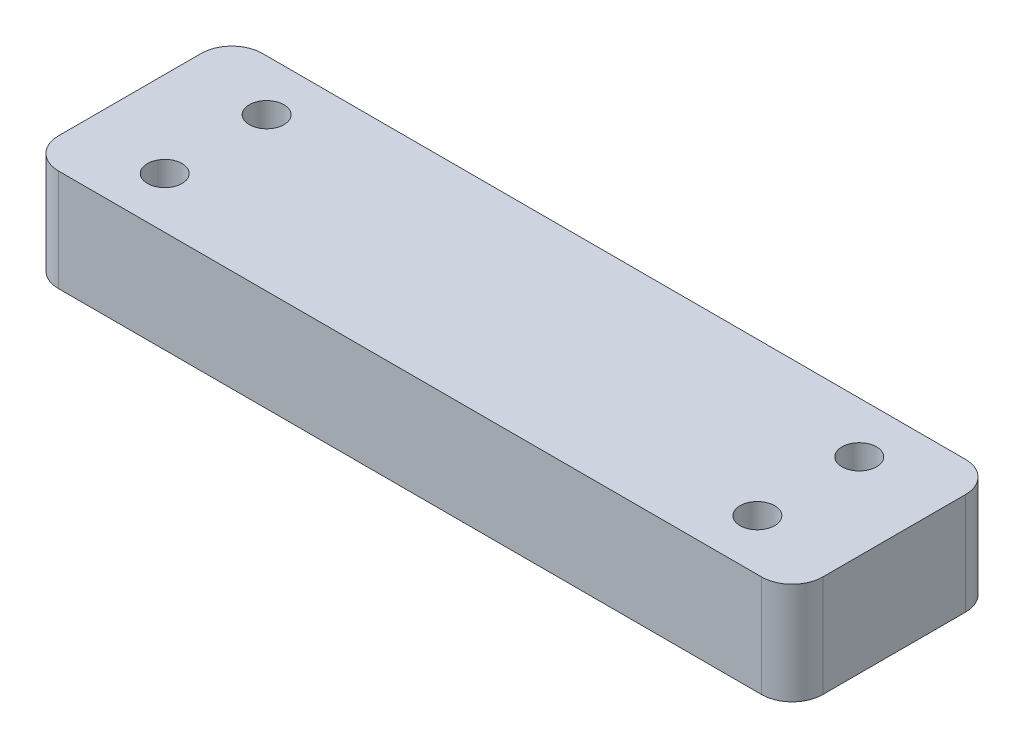
ISO-10303-21;
HEADER;
FILE_DESCRIPTION(('STEP AP214'),'2;1');
FILE_NAME('part.step','',(''),(''),'','','');
FILE_SCHEMA(('AUTOMOTIVE_DESIGN { 1 0 10303 214 1 1 1 1 }'));
ENDSEC;
DATA;
#1=APPLICATION_CONTEXT('core data for automotive mechanical design processes');
#2=APPLICATION_PROTOCOL_DEFINITION('international standard','automotive_design',2000,#1);
#3=PRODUCT_CONTEXT('',#1,'mechanical');
#4=PRODUCT('Part','Part','',(#3));
#5=PRODUCT_RELATED_PRODUCT_CATEGORY('part','',(#4));
#6=PRODUCT_DEFINITION_FORMATION('','',#4);
#7=PRODUCT_DEFINITION_CONTEXT('part definition',#1,'design');
#8=PRODUCT_DEFINITION('design','',#6,#7);
#9=PRODUCT_DEFINITION_SHAPE('','',#8);
#10=(LENGTH_UNIT() NAMED_UNIT(*) SI_UNIT(.MILLI.,.METRE.));
#11=(NAMED_UNIT(*) PLANE_ANGLE_UNIT() SI_UNIT($,.RADIAN.));
#12=(NAMED_UNIT(*) SI_UNIT($,.STERADIAN.) SOLID_ANGLE_UNIT());
#13=UNCERTAINTY_MEASURE_WITH_UNIT(LENGTH_MEASURE(1.E-05),#10,'distance_accuracy_value','');
#14=(GEOMETRIC_REPRESENTATION_CONTEXT(3) GLOBAL_UNCERTAINTY_ASSIGNED_CONTEXT((#13)) GLOBAL_UNIT_ASSIGNED_CONTEXT((#10,
#11,#12)) REPRESENTATION_CONTEXT('',''));
#15=CARTESIAN_POINT('',(0.,0.,0.));
#16=DIRECTION('',(0.,0.,1.));
#17=DIRECTION('',(1.,0.,0.));
#18=AXIS2_PLACEMENT_3D('',#15,#16,#17);
#19=CARTESIAN_POINT('',(0.,10.,0.));
#20=DIRECTION('',(0.,-1.,0.));
#21=DIRECTION('',(0.,0.,-1.));
#22=AXIS2_PLACEMENT_3D('',#19,#20,#21);
#23=PLANE('',#22);
#24=CARTESIAN_POINT('',(66.5810000000001,10.,-15.));
#25=DIRECTION('',(0.,1.,0.));
#26=DIRECTION('',(0.,0.,1.));
#27=AXIS2_PLACEMENT_3D('',#24,#25,#26);
#28=CIRCLE('',#27,1.69999999999999);
#29=CARTESIAN_POINT('',(66.5810000000001,10.,-13.3));
#30=VERTEX_POINT('',#29);
#31=EDGE_CURVE('E194',#30,#30,#28,.T.);
#32=ORIENTED_EDGE('',*,*,#31,.F.);
#33=EDGE_LOOP('',(#32));
#34=FACE_BOUND('',#33,.T.);
#35=DIRECTION('',(-1.,0.,0.));
#36=VECTOR('',#35,1.);
#37=CARTESIAN_POINT('',(0.,10.,-20.));
#38=LINE('',#37,#36);
#39=CARTESIAN_POINT('',(72.,10.,-20.));
#40=VERTEX_POINT('',#39);
#41=CARTESIAN_POINT('',(3.,10.,-20.));
#42=VERTEX_POINT('',#41);
#43=EDGE_CURVE('E134',#40,#42,#38,.T.);
#44=ORIENTED_EDGE('',*,*,#43,.T.);
#45=CARTESIAN_POINT('',(3.,10.,-17.));
#46=DIRECTION('',(0.,-1.,0.));
#47=DIRECTION('',(0.,0.,-1.));
#48=AXIS2_PLACEMENT_3D('',#45,#46,#47);
#49=CIRCLE('',#48,3.);
#50=CARTESIAN_POINT('',(0.,10.,-17.));
#51=VERTEX_POINT('',#50);
#52=EDGE_CURVE('E153',#42,#51,#49,.F.);
#53=ORIENTED_EDGE('',*,*,#52,.T.);
#54=DIRECTION('',(0.,0.,1.));
#55=VECTOR('',#54,1.);
#56=CARTESIAN_POINT('',(0.,10.,0.));
#57=LINE('',#56,#55);
#58=CARTESIAN_POINT('',(0.,10.,-3.));
#59=VERTEX_POINT('',#58);
#60=EDGE_CURVE('E118',#51,#59,#57,.T.);
#61=ORIENTED_EDGE('',*,*,#60,.T.);
#62=CARTESIAN_POINT('',(3.,10.,-3.));
#63=DIRECTION('',(0.,-1.,0.));
#64=DIRECTION('',(0.,0.,-1.));
#65=AXIS2_PLACEMENT_3D('',#62,#63,#64);
#66=CIRCLE('',#65,3.);
#67=CARTESIAN_POINT('',(3.,10.,0.));
#68=VERTEX_POINT('',#67);
#69=EDGE_CURVE('E151',#59,#68,#66,.F.);
#70=ORIENTED_EDGE('',*,*,#69,.T.);
#71=DIRECTION('',(1.,0.,0.));
#72=VECTOR('',#71,1.);
#73=CARTESIAN_POINT('',(0.,10.,0.));
#74=LINE('',#73,#72);
#75=CARTESIAN_POINT('',(72.,10.,0.));
#76=VERTEX_POINT('',#75);
#77=EDGE_CURVE('E173',#68,#76,#74,.T.);
#78=ORIENTED_EDGE('',*,*,#77,.T.);
#79=CARTESIAN_POINT('',(72.,10.,-3.));
#80=DIRECTION('',(0.,-1.,0.));
#81=DIRECTION('',(0.,0.,-1.));
#82=AXIS2_PLACEMENT_3D('',#79,#80,#81);
#83=CIRCLE('',#82,3.);
#84=CARTESIAN_POINT('',(75.,10.,-3.));
#85=VERTEX_POINT('',#84);
#86=EDGE_CURVE('E53',#76,#85,#83,.F.);
#87=ORIENTED_EDGE('',*,*,#86,.T.);
#88=DIRECTION('',(0.,0.,-1.));
#89=VECTOR('',#88,1.);
#90=CARTESIAN_POINT('',(75.,10.,0.));
#91=LINE('',#90,#89);
#92=CARTESIAN_POINT('',(75.,10.,-17.));
#93=VERTEX_POINT('',#92);
#94=EDGE_CURVE('E163',#85,#93,#91,.T.);
#95=ORIENTED_EDGE('',*,*,#94,.T.);
#96=CARTESIAN_POINT('',(72.,10.,-17.));
#97=DIRECTION('',(0.,-1.,0.));
#98=DIRECTION('',(0.,0.,-1.));
#99=AXIS2_PLACEMENT_3D('',#96,#97,#98);
#100=CIRCLE('',#99,3.);
#101=EDGE_CURVE('E149',#93,#40,#100,.F.);
#102=ORIENTED_EDGE('',*,*,#101,.T.);
#103=EDGE_LOOP('',(#44,#53,#61,#70,#78,#87,#95,#102));
#104=FACE_BOUND('',#103,.T.);
#105=CARTESIAN_POINT('',(8.41899999999998,10.,-15.));
#106=DIRECTION('',(0.,1.,0.));
#107=DIRECTION('',(0.,0.,1.));
#108=AXIS2_PLACEMENT_3D('',#105,#106,#107);
#109=CIRCLE('',#108,1.69999999999999);
#110=CARTESIAN_POINT('',(8.41899999999998,10.,-13.3));
#111=VERTEX_POINT('',#110);
#112=EDGE_CURVE('E131',#111,#111,#109,.T.);
#113=ORIENTED_EDGE('',*,*,#112,.F.);
#114=EDGE_LOOP('',(#113));
#115=FACE_BOUND('',#114,.T.);
#116=CARTESIAN_POINT('',(8.41899999999998,10.,-5.));
#117=DIRECTION('',(0.,1.,0.));
#118=DIRECTION('',(0.,0.,1.));
#119=AXIS2_PLACEMENT_3D('',#116,#117,#118);
#120=CIRCLE('',#119,1.69999999999999);
#121=CARTESIAN_POINT('',(8.41899999999998,10.,-3.30000000000001));
#122=VERTEX_POINT('',#121);
#123=EDGE_CURVE('E182',#122,#122,#120,.T.);
#124=ORIENTED_EDGE('',*,*,#123,.F.);
#125=EDGE_LOOP('',(#124));
#126=FACE_BOUND('',#125,.T.);
#127=CARTESIAN_POINT('',(66.5810000000001,10.,-5.));
#128=DIRECTION('',(0.,1.,0.));
#129=DIRECTION('',(0.,0.,1.));
#130=AXIS2_PLACEMENT_3D('',#127,#128,#129);
#131=CIRCLE('',#130,1.69999999999999);
#132=CARTESIAN_POINT('',(66.5810000000001,10.,-3.30000000000001));
#133=VERTEX_POINT('',#132);
#134=EDGE_CURVE('E188',#133,#133,#131,.T.);
#135=ORIENTED_EDGE('',*,*,#134,.F.);
#136=EDGE_LOOP('',(#135));
#137=FACE_BOUND('',#136,.T.);
#138=ADVANCED_FACE('F33',(#34,#104,#115,#126,#137),#23,.F.);
#139=CARTESIAN_POINT('',(0.,10.,0.));
#140=DIRECTION('',(1.,0.,0.));
#141=DIRECTION('',(0.,0.,-1.));
#142=AXIS2_PLACEMENT_3D('',#139,#140,#141);
#143=PLANE('',#142);
#144=ORIENTED_EDGE('',*,*,#60,.F.);
#145=DIRECTION('',(0.,-1.,0.));
#146=VECTOR('',#145,1.);
#147=CARTESIAN_POINT('',(0.,10.,-17.));
#148=LINE('',#147,#146);
#149=CARTESIAN_POINT('',(0.,0.,-17.));
#150=VERTEX_POINT('',#149);
#151=EDGE_CURVE('E102',#51,#150,#148,.T.);
#152=ORIENTED_EDGE('',*,*,#151,.T.);
#153=DIRECTION('',(0.,0.,1.));
#154=VECTOR('',#153,1.);
#155=CARTESIAN_POINT('',(0.,0.,0.));
#156=LINE('',#155,#154);
#157=CARTESIAN_POINT('',(0.,0.,-3.));
#158=VERTEX_POINT('',#157);
#159=EDGE_CURVE('E115',#150,#158,#156,.T.);
#160=ORIENTED_EDGE('',*,*,#159,.T.);
#161=DIRECTION('',(0.,-1.,0.));
#162=VECTOR('',#161,1.);
#163=CARTESIAN_POINT('',(0.,10.,-3.));
#164=LINE('',#163,#162);
#165=EDGE_CURVE('E120',#158,#59,#164,.F.);
#166=ORIENTED_EDGE('',*,*,#165,.T.);
#167=EDGE_LOOP('',(#144,#152,#160,#166));
#168=FACE_BOUND('',#167,.T.);
#169=ADVANCED_FACE('F114',(#168),#143,.F.);
#170=CARTESIAN_POINT('',(0.,10.,0.));
#171=DIRECTION('',(0.,0.,-1.));
#172=DIRECTION('',(-1.,0.,0.));
#173=AXIS2_PLACEMENT_3D('',#170,#171,#172);
#174=PLANE('',#173);
#175=ORIENTED_EDGE('',*,*,#77,.F.);
#176=DIRECTION('',(0.,-1.,0.));
#177=VECTOR('',#176,1.);
#178=CARTESIAN_POINT('',(3.,10.,0.));
#179=LINE('',#178,#177);
#180=CARTESIAN_POINT('',(3.,0.,0.));
#181=VERTEX_POINT('',#180);
#182=EDGE_CURVE('E157',#68,#181,#179,.T.);
#183=ORIENTED_EDGE('',*,*,#182,.T.);
#184=DIRECTION('',(1.,0.,0.));
#185=VECTOR('',#184,1.);
#186=CARTESIAN_POINT('',(0.,0.,0.));
#187=LINE('',#186,#185);
#188=CARTESIAN_POINT('',(72.,0.,0.));
#189=VERTEX_POINT('',#188);
#190=EDGE_CURVE('E124',#181,#189,#187,.T.);
#191=ORIENTED_EDGE('',*,*,#190,.T.);
#192=DIRECTION('',(0.,-1.,0.));
#193=VECTOR('',#192,1.);
#194=CARTESIAN_POINT('',(72.,10.,0.));
#195=LINE('',#194,#193);
#196=EDGE_CURVE('E155',#189,#76,#195,.F.);
#197=ORIENTED_EDGE('',*,*,#196,.T.);
#198=EDGE_LOOP('',(#175,#183,#191,#197));
#199=FACE_BOUND('',#198,.T.);
#200=ADVANCED_FACE('F235',(#199),#174,.F.);
#201=CARTESIAN_POINT('',(75.,10.,0.));
#202=DIRECTION('',(-1.,0.,0.));
#203=DIRECTION('',(0.,0.,1.));
#204=AXIS2_PLACEMENT_3D('',#201,#202,#203);
#205=PLANE('',#204);
#206=DIRECTION('',(0.,0.,-1.));
#207=VECTOR('',#206,1.);
#208=CARTESIAN_POINT('',(75.,0.,0.));
#209=LINE('',#208,#207);
#210=CARTESIAN_POINT('',(75.,0.,-3.));
#211=VERTEX_POINT('',#210);
#212=CARTESIAN_POINT('',(75.,0.,-17.));
#213=VERTEX_POINT('',#212);
#214=EDGE_CURVE('E128',#211,#213,#209,.T.);
#215=ORIENTED_EDGE('',*,*,#214,.T.);
#216=DIRECTION('',(0.,-1.,0.));
#217=VECTOR('',#216,1.);
#218=CARTESIAN_POINT('',(75.,10.,-17.));
#219=LINE('',#218,#217);
#220=EDGE_CURVE('E11',#213,#93,#219,.F.);
#221=ORIENTED_EDGE('',*,*,#220,.T.);
#222=ORIENTED_EDGE('',*,*,#94,.F.);
#223=DIRECTION('',(0.,-1.,0.));
#224=VECTOR('',#223,1.);
#225=CARTESIAN_POINT('',(75.,10.,-3.));
#226=LINE('',#225,#224);
#227=EDGE_CURVE('E41',#85,#211,#226,.T.);
#228=ORIENTED_EDGE('',*,*,#227,.T.);
#229=EDGE_LOOP('',(#215,#221,#222,#228));
#230=FACE_BOUND('',#229,.T.);
#231=ADVANCED_FACE('F162',(#230),#205,.F.);
#232=CARTESIAN_POINT('',(0.,10.,-20.));
#233=DIRECTION('',(0.,0.,1.));
#234=DIRECTION('',(1.,0.,0.));
#235=AXIS2_PLACEMENT_3D('',#232,#233,#234);
#236=PLANE('',#235);
#237=DIRECTION('',(-1.,0.,0.));
#238=VECTOR('',#237,1.);
#239=CARTESIAN_POINT('',(0.,0.,-20.));
#240=LINE('',#239,#238);
#241=CARTESIAN_POINT('',(72.,0.,-20.));
#242=VERTEX_POINT('',#241);
#243=CARTESIAN_POINT('',(3.,0.,-20.));
#244=VERTEX_POINT('',#243);
#245=EDGE_CURVE('E138',#242,#244,#240,.T.);
#246=ORIENTED_EDGE('',*,*,#245,.T.);
#247=DIRECTION('',(0.,-1.,0.));
#248=VECTOR('',#247,1.);
#249=CARTESIAN_POINT('',(3.,10.,-20.));
#250=LINE('',#249,#248);
#251=EDGE_CURVE('E103',#244,#42,#250,.F.);
#252=ORIENTED_EDGE('',*,*,#251,.T.);
#253=ORIENTED_EDGE('',*,*,#43,.F.);
#254=DIRECTION('',(0.,-1.,0.));
#255=VECTOR('',#254,1.);
#256=CARTESIAN_POINT('',(72.,10.,-20.));
#257=LINE('',#256,#255);
#258=EDGE_CURVE('E108',#40,#242,#257,.T.);
#259=ORIENTED_EDGE('',*,*,#258,.T.);
#260=EDGE_LOOP('',(#246,#252,#253,#259));
#261=FACE_BOUND('',#260,.T.);
#262=ADVANCED_FACE('F171',(#261),#236,.F.);
#263=CARTESIAN_POINT('',(0.,0.,0.));
#264=DIRECTION('',(0.,-1.,0.));
#265=DIRECTION('',(0.,0.,-1.));
#266=AXIS2_PLACEMENT_3D('',#263,#264,#265);
#267=PLANE('',#266);
#268=CARTESIAN_POINT('',(66.5810000000001,0.,-15.));
#269=DIRECTION('',(0.,1.,0.));
#270=DIRECTION('',(0.,0.,1.));
#271=AXIS2_PLACEMENT_3D('',#268,#269,#270);
#272=CIRCLE('',#271,1.69999999999998);
#273=CARTESIAN_POINT('',(66.5810000000001,0.,-13.3));
#274=VERTEX_POINT('',#273);
#275=EDGE_CURVE('E191',#274,#274,#272,.T.);
#276=ORIENTED_EDGE('',*,*,#275,.T.);
#277=EDGE_LOOP('',(#276));
#278=FACE_BOUND('',#277,.T.);
#279=CARTESIAN_POINT('',(66.5810000000001,0.,-5.));
#280=DIRECTION('',(0.,1.,0.));
#281=DIRECTION('',(0.,0.,1.));
#282=AXIS2_PLACEMENT_3D('',#279,#280,#281);
#283=CIRCLE('',#282,1.69999999999999);
#284=CARTESIAN_POINT('',(66.5810000000001,0.,-3.30000000000001));
#285=VERTEX_POINT('',#284);
#286=EDGE_CURVE('E185',#285,#285,#283,.T.);
#287=ORIENTED_EDGE('',*,*,#286,.T.);
#288=EDGE_LOOP('',(#287));
#289=FACE_BOUND('',#288,.T.);
#290=CARTESIAN_POINT('',(8.41899999999998,0.,-5.));
#291=DIRECTION('',(0.,1.,0.));
#292=DIRECTION('',(0.,0.,1.));
#293=AXIS2_PLACEMENT_3D('',#290,#291,#292);
#294=CIRCLE('',#293,1.69999999999999);
#295=CARTESIAN_POINT('',(8.41899999999998,0.,-3.30000000000001));
#296=VERTEX_POINT('',#295);
#297=EDGE_CURVE('E179',#296,#296,#294,.T.);
#298=ORIENTED_EDGE('',*,*,#297,.T.);
#299=EDGE_LOOP('',(#298));
#300=FACE_BOUND('',#299,.T.);
#301=CARTESIAN_POINT('',(8.41899999999998,0.,-15.));
#302=DIRECTION('',(0.,1.,0.));
#303=DIRECTION('',(0.,0.,1.));
#304=AXIS2_PLACEMENT_3D('',#301,#302,#303);
#305=CIRCLE('',#304,1.69999999999999);
#306=CARTESIAN_POINT('',(8.41899999999998,0.,-13.3));
#307=VERTEX_POINT('',#306);
#308=EDGE_CURVE('E125',#307,#307,#305,.T.);
#309=ORIENTED_EDGE('',*,*,#308,.T.);
#310=EDGE_LOOP('',(#309));
#311=FACE_BOUND('',#310,.T.);
#312=ORIENTED_EDGE('',*,*,#159,.F.);
#313=CARTESIAN_POINT('',(3.,0.,-17.));
#314=DIRECTION('',(0.,-1.,0.));
#315=DIRECTION('',(0.,0.,-1.));
#316=AXIS2_PLACEMENT_3D('',#313,#314,#315);
#317=CIRCLE('',#316,3.);
#318=EDGE_CURVE('E98',#150,#244,#317,.T.);
#319=ORIENTED_EDGE('',*,*,#318,.T.);
#320=ORIENTED_EDGE('',*,*,#245,.F.);
#321=CARTESIAN_POINT('',(72.,0.,-17.));
#322=DIRECTION('',(0.,-1.,0.));
#323=DIRECTION('',(0.,0.,-1.));
#324=AXIS2_PLACEMENT_3D('',#321,#322,#323);
#325=CIRCLE('',#324,3.);
#326=EDGE_CURVE('E142',#242,#213,#325,.T.);
#327=ORIENTED_EDGE('',*,*,#326,.T.);
#328=ORIENTED_EDGE('',*,*,#214,.F.);
#329=CARTESIAN_POINT('',(72.,0.,-3.));
#330=DIRECTION('',(0.,-1.,0.));
#331=DIRECTION('',(0.,0.,-1.));
#332=AXIS2_PLACEMENT_3D('',#329,#330,#331);
#333=CIRCLE('',#332,3.);
#334=EDGE_CURVE('E119',#211,#189,#333,.T.);
#335=ORIENTED_EDGE('',*,*,#334,.T.);
#336=ORIENTED_EDGE('',*,*,#190,.F.);
#337=CARTESIAN_POINT('',(3.,0.,-3.));
#338=DIRECTION('',(0.,-1.,0.));
#339=DIRECTION('',(0.,0.,-1.));
#340=AXIS2_PLACEMENT_3D('',#337,#338,#339);
#341=CIRCLE('',#340,3.);
#342=EDGE_CURVE('E109',#181,#158,#341,.T.);
#343=ORIENTED_EDGE('',*,*,#342,.T.);
#344=EDGE_LOOP('',(#312,#319,#320,#327,#328,#335,#336,#343));
#345=FACE_BOUND('',#344,.T.);
#346=ADVANCED_FACE('F122',(#278,#289,#300,#311,#345),#267,.T.);
#347=CARTESIAN_POINT('',(3.,10.,-17.));
#348=DIRECTION('',(0.,-1.,0.));
#349=DIRECTION('',(0.,0.,-1.));
#350=AXIS2_PLACEMENT_3D('',#347,#348,#349);
#351=CYLINDRICAL_SURFACE('',#350,3.);
#352=ORIENTED_EDGE('',*,*,#52,.F.);
#353=ORIENTED_EDGE('',*,*,#251,.F.);
#354=ORIENTED_EDGE('',*,*,#318,.F.);
#355=ORIENTED_EDGE('',*,*,#151,.F.);
#356=EDGE_LOOP('',(#352,#353,#354,#355));
#357=FACE_BOUND('',#356,.T.);
#358=ADVANCED_FACE('F101',(#357),#351,.T.);
#359=CARTESIAN_POINT('',(3.,10.,-3.));
#360=DIRECTION('',(0.,-1.,0.));
#361=DIRECTION('',(0.,0.,-1.));
#362=AXIS2_PLACEMENT_3D('',#359,#360,#361);
#363=CYLINDRICAL_SURFACE('',#362,3.);
#364=ORIENTED_EDGE('',*,*,#69,.F.);
#365=ORIENTED_EDGE('',*,*,#165,.F.);
#366=ORIENTED_EDGE('',*,*,#342,.F.);
#367=ORIENTED_EDGE('',*,*,#182,.F.);
#368=EDGE_LOOP('',(#364,#365,#366,#367));
#369=FACE_BOUND('',#368,.T.);
#370=ADVANCED_FACE('F243',(#369),#363,.T.);
#371=CARTESIAN_POINT('',(72.,10.,-17.));
#372=DIRECTION('',(0.,-1.,0.));
#373=DIRECTION('',(0.,0.,-1.));
#374=AXIS2_PLACEMENT_3D('',#371,#372,#373);
#375=CYLINDRICAL_SURFACE('',#374,3.);
#376=ORIENTED_EDGE('',*,*,#101,.F.);
#377=ORIENTED_EDGE('',*,*,#220,.F.);
#378=ORIENTED_EDGE('',*,*,#326,.F.);
#379=ORIENTED_EDGE('',*,*,#258,.F.);
#380=EDGE_LOOP('',(#376,#377,#378,#379));
#381=FACE_BOUND('',#380,.T.);
#382=ADVANCED_FACE('F168',(#381),#375,.T.);
#383=CARTESIAN_POINT('',(72.,10.,-3.));
#384=DIRECTION('',(0.,-1.,0.));
#385=DIRECTION('',(0.,0.,-1.));
#386=AXIS2_PLACEMENT_3D('',#383,#384,#385);
#387=CYLINDRICAL_SURFACE('',#386,3.);
#388=ORIENTED_EDGE('',*,*,#86,.F.);
#389=ORIENTED_EDGE('',*,*,#196,.F.);
#390=ORIENTED_EDGE('',*,*,#334,.F.);
#391=ORIENTED_EDGE('',*,*,#227,.F.);
#392=EDGE_LOOP('',(#388,#389,#390,#391));
#393=FACE_BOUND('',#392,.T.);
#394=ADVANCED_FACE('F35',(#393),#387,.T.);
#395=CARTESIAN_POINT('',(8.41899999999998,10.,-15.));
#396=DIRECTION('',(0.,1.,0.));
#397=DIRECTION('',(0.,0.,1.));
#398=AXIS2_PLACEMENT_3D('',#395,#396,#397);
#399=CYLINDRICAL_SURFACE('',#398,1.69999999999999);
#400=ORIENTED_EDGE('',*,*,#308,.F.);
#401=EDGE_LOOP('',(#400));
#402=FACE_BOUND('',#401,.T.);
#403=ORIENTED_EDGE('',*,*,#112,.T.);
#404=EDGE_LOOP('',(#403));
#405=FACE_BOUND('',#404,.T.);
#406=ADVANCED_FACE('F220',(#402,#405),#399,.F.);
#407=CARTESIAN_POINT('',(8.41899999999998,10.,-5.));
#408=DIRECTION('',(0.,1.,0.));
#409=DIRECTION('',(0.,0.,1.));
#410=AXIS2_PLACEMENT_3D('',#407,#408,#409);
#411=CYLINDRICAL_SURFACE('',#410,1.69999999999999);
#412=ORIENTED_EDGE('',*,*,#297,.F.);
#413=EDGE_LOOP('',(#412));
#414=FACE_BOUND('',#413,.T.);
#415=ORIENTED_EDGE('',*,*,#123,.T.);
#416=EDGE_LOOP('',(#415));
#417=FACE_BOUND('',#416,.T.);
#418=ADVANCED_FACE('F211',(#414,#417),#411,.F.);
#419=CARTESIAN_POINT('',(66.5810000000001,10.,-5.));
#420=DIRECTION('',(0.,1.,0.));
#421=DIRECTION('',(0.,0.,1.));
#422=AXIS2_PLACEMENT_3D('',#419,#420,#421);
#423=CYLINDRICAL_SURFACE('',#422,1.69999999999999);
#424=ORIENTED_EDGE('',*,*,#286,.F.);
#425=EDGE_LOOP('',(#424));
#426=FACE_BOUND('',#425,.T.);
#427=ORIENTED_EDGE('',*,*,#134,.T.);
#428=EDGE_LOOP('',(#427));
#429=FACE_BOUND('',#428,.T.);
#430=ADVANCED_FACE('F209',(#426,#429),#423,.F.);
#431=CARTESIAN_POINT('',(66.5810000000001,10.,-15.));
#432=DIRECTION('',(0.,1.,0.));
#433=DIRECTION('',(0.,0.,1.));
#434=AXIS2_PLACEMENT_3D('',#431,#432,#433);
#435=CYLINDRICAL_SURFACE('',#434,1.69999999999999);
#436=ORIENTED_EDGE('',*,*,#275,.F.);
#437=EDGE_LOOP('',(#436));
#438=FACE_BOUND('',#437,.T.);
#439=ORIENTED_EDGE('',*,*,#31,.T.);
#440=EDGE_LOOP('',(#439));
#441=FACE_BOUND('',#440,.T.);
#442=ADVANCED_FACE('F198',(#438,#441),#435,.F.);
#443=CLOSED_SHELL('',(#138,#169,#200,#231,#262,#346,#358,#370,#382,#394,#406,#418,#430,#442));
#444=MANIFOLD_SOLID_BREP('B2',#443);
#445=ADVANCED_BREP_SHAPE_REPRESENTATION('',(#18,#444),#14);
#446=SHAPE_DEFINITION_REPRESENTATION(#9,#445);
ENDSEC;
END-ISO-10303-21;
